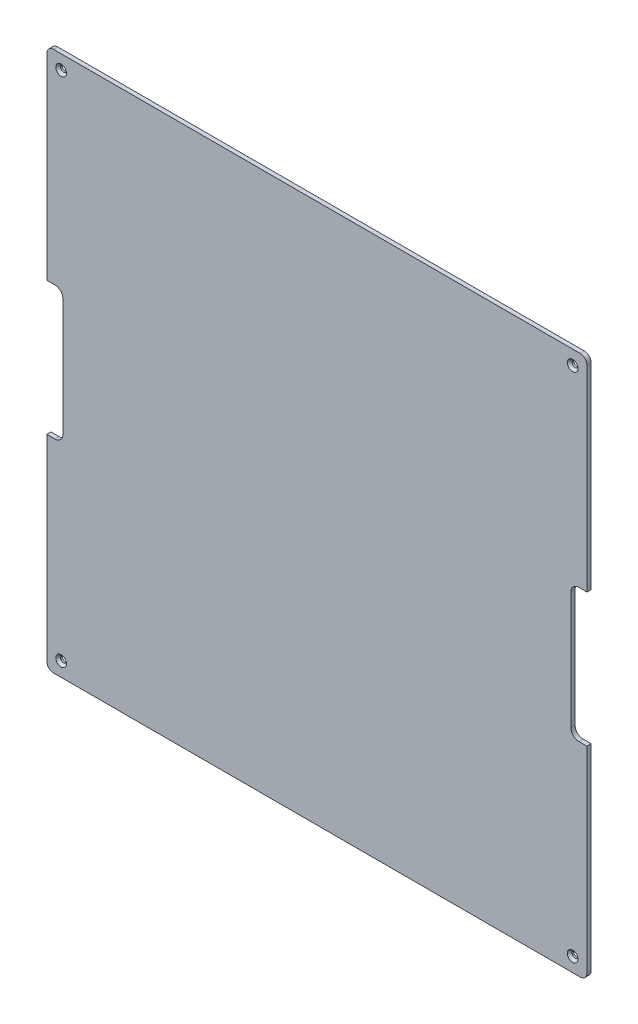
ISO-10303-21;
HEADER;
FILE_DESCRIPTION(('STEP AP214'),'2;1');
FILE_NAME('part.step','',(''),(''),'','','');
FILE_SCHEMA(('AUTOMOTIVE_DESIGN { 1 0 10303 214 1 1 1 1 }'));
ENDSEC;
DATA;
#1=APPLICATION_CONTEXT('core data for automotive mechanical design processes');
#2=APPLICATION_PROTOCOL_DEFINITION('international standard','automotive_design',2000,#1);
#3=PRODUCT_CONTEXT('',#1,'mechanical');
#4=PRODUCT('Part','Part','',(#3));
#5=PRODUCT_RELATED_PRODUCT_CATEGORY('part','',(#4));
#6=PRODUCT_DEFINITION_FORMATION('','',#4);
#7=PRODUCT_DEFINITION_CONTEXT('part definition',#1,'design');
#8=PRODUCT_DEFINITION('design','',#6,#7);
#9=PRODUCT_DEFINITION_SHAPE('','',#8);
#10=(LENGTH_UNIT() NAMED_UNIT(*) SI_UNIT(.MILLI.,.METRE.));
#11=(NAMED_UNIT(*) PLANE_ANGLE_UNIT() SI_UNIT($,.RADIAN.));
#12=(NAMED_UNIT(*) SI_UNIT($,.STERADIAN.) SOLID_ANGLE_UNIT());
#13=UNCERTAINTY_MEASURE_WITH_UNIT(LENGTH_MEASURE(1.E-05),#10,'distance_accuracy_value','');
#14=(GEOMETRIC_REPRESENTATION_CONTEXT(3) GLOBAL_UNCERTAINTY_ASSIGNED_CONTEXT((#13)) GLOBAL_UNIT_ASSIGNED_CONTEXT((#10,
#11,#12)) REPRESENTATION_CONTEXT('',''));
#15=CARTESIAN_POINT('',(0.,0.,0.));
#16=DIRECTION('',(0.,0.,1.));
#17=DIRECTION('',(1.,0.,0.));
#18=AXIS2_PLACEMENT_3D('',#15,#16,#17);
#19=CARTESIAN_POINT('',(3.3021810973961,129.997818902604,1.5748));
#20=DIRECTION('',(0.,1.,0.));
#21=DIRECTION('',(0.,0.,1.));
#22=AXIS2_PLACEMENT_3D('',#19,#20,#21);
#23=PLANE('',#22);
#24=DIRECTION('',(0.,0.,-1.));
#25=VECTOR('',#24,1.);
#26=CARTESIAN_POINT('',(3.80218109739611,129.997818902604,-0.000999999999999916));
#27=LINE('',#26,#25);
#28=CARTESIAN_POINT('',(3.80218109739611,129.997818902604,1.5748));
#29=VERTEX_POINT('',#28);
#30=CARTESIAN_POINT('',(3.80218109739611,129.997818902604,0.));
#31=VERTEX_POINT('',#30);
#32=EDGE_CURVE('E299',#29,#31,#27,.T.);
#33=ORIENTED_EDGE('',*,*,#32,.T.);
#34=DIRECTION('',(1.,0.,0.));
#35=VECTOR('',#34,1.);
#36=CARTESIAN_POINT('',(3.3021810973961,129.997818902604,0.));
#37=LINE('',#36,#35);
#38=CARTESIAN_POINT('',(6.8221810973961,129.997818902604,0.));
#39=VERTEX_POINT('',#38);
#40=EDGE_CURVE('E201',#31,#39,#37,.T.);
#41=ORIENTED_EDGE('',*,*,#40,.T.);
#42=DIRECTION('',(0.,0.,-1.));
#43=VECTOR('',#42,1.);
#44=CARTESIAN_POINT('',(6.8221810973961,129.997818902604,1.5748));
#45=LINE('',#44,#43);
#46=CARTESIAN_POINT('',(6.8221810973961,129.997818902604,1.5748));
#47=VERTEX_POINT('',#46);
#48=EDGE_CURVE('E228',#39,#47,#45,.F.);
#49=ORIENTED_EDGE('',*,*,#48,.T.);
#50=DIRECTION('',(1.,0.,0.));
#51=VECTOR('',#50,1.);
#52=CARTESIAN_POINT('',(3.3021810973961,129.997818902604,1.5748));
#53=LINE('',#52,#51);
#54=EDGE_CURVE('E210',#29,#47,#53,.T.);
#55=ORIENTED_EDGE('',*,*,#54,.F.);
#56=EDGE_LOOP('',(#33,#41,#49,#55));
#57=FACE_BOUND('',#56,.T.);
#58=ADVANCED_FACE('F33',(#57),#23,.F.);
#59=CARTESIAN_POINT('',(3.30218109739611,79.9978189026039,1.5748));
#60=DIRECTION('',(0.,-1.,0.));
#61=DIRECTION('',(0.,0.,-1.));
#62=AXIS2_PLACEMENT_3D('',#59,#60,#61);
#63=PLANE('',#62);
#64=DIRECTION('',(0.,0.,1.));
#65=VECTOR('',#64,1.);
#66=CARTESIAN_POINT('',(3.80218109739612,79.9978189026039,-0.000999999999999916));
#67=LINE('',#66,#65);
#68=CARTESIAN_POINT('',(3.80218109739611,79.9978189026039,0.));
#69=VERTEX_POINT('',#68);
#70=CARTESIAN_POINT('',(3.80218109739611,79.9978189026039,1.5748));
#71=VERTEX_POINT('',#70);
#72=EDGE_CURVE('E168',#69,#71,#67,.T.);
#73=ORIENTED_EDGE('',*,*,#72,.T.);
#74=DIRECTION('',(-1.,0.,0.));
#75=VECTOR('',#74,1.);
#76=CARTESIAN_POINT('',(3.30218109739611,79.9978189026039,1.5748));
#77=LINE('',#76,#75);
#78=CARTESIAN_POINT('',(6.82218109739611,79.9978189026039,1.5748));
#79=VERTEX_POINT('',#78);
#80=EDGE_CURVE('E257',#79,#71,#77,.T.);
#81=ORIENTED_EDGE('',*,*,#80,.F.);
#82=DIRECTION('',(0.,0.,-1.));
#83=VECTOR('',#82,1.);
#84=CARTESIAN_POINT('',(6.82218109739611,79.9978189026039,0.));
#85=LINE('',#84,#83);
#86=CARTESIAN_POINT('',(6.82218109739611,79.9978189026039,0.));
#87=VERTEX_POINT('',#86);
#88=EDGE_CURVE('E194',#79,#87,#85,.T.);
#89=ORIENTED_EDGE('',*,*,#88,.T.);
#90=DIRECTION('',(-1.,0.,0.));
#91=VECTOR('',#90,1.);
#92=CARTESIAN_POINT('',(3.30218109739611,79.9978189026039,0.));
#93=LINE('',#92,#91);
#94=EDGE_CURVE('E186',#87,#69,#93,.T.);
#95=ORIENTED_EDGE('',*,*,#94,.T.);
#96=EDGE_LOOP('',(#73,#81,#89,#95));
#97=FACE_BOUND('',#96,.T.);
#98=ADVANCED_FACE('F192',(#97),#63,.F.);
#99=CARTESIAN_POINT('',(206.702181097396,79.9978189026039,1.5748));
#100=DIRECTION('',(0.,-1.,0.));
#101=DIRECTION('',(0.,0.,-1.));
#102=AXIS2_PLACEMENT_3D('',#99,#100,#101);
#103=PLANE('',#102);
#104=DIRECTION('',(0.,0.,-1.));
#105=VECTOR('',#104,1.);
#106=CARTESIAN_POINT('',(206.202181097396,79.9978189026039,-0.000999999999999916));
#107=LINE('',#106,#105);
#108=CARTESIAN_POINT('',(206.202181097396,79.9978189026039,1.5748));
#109=VERTEX_POINT('',#108);
#110=CARTESIAN_POINT('',(206.202181097396,79.9978189026039,0.));
#111=VERTEX_POINT('',#110);
#112=EDGE_CURVE('E180',#109,#111,#107,.T.);
#113=ORIENTED_EDGE('',*,*,#112,.T.);
#114=DIRECTION('',(-1.,0.,0.));
#115=VECTOR('',#114,1.);
#116=CARTESIAN_POINT('',(206.702181097396,79.9978189026039,0.));
#117=LINE('',#116,#115);
#118=CARTESIAN_POINT('',(203.182181097396,79.9978189026039,0.));
#119=VERTEX_POINT('',#118);
#120=EDGE_CURVE('E195',#111,#119,#117,.T.);
#121=ORIENTED_EDGE('',*,*,#120,.T.);
#122=DIRECTION('',(0.,0.,-1.));
#123=VECTOR('',#122,1.);
#124=CARTESIAN_POINT('',(203.182181097396,79.9978189026039,1.5748));
#125=LINE('',#124,#123);
#126=CARTESIAN_POINT('',(203.182181097396,79.9978189026039,1.5748));
#127=VERTEX_POINT('',#126);
#128=EDGE_CURVE('E220',#119,#127,#125,.F.);
#129=ORIENTED_EDGE('',*,*,#128,.T.);
#130=DIRECTION('',(-1.,0.,0.));
#131=VECTOR('',#130,1.);
#132=CARTESIAN_POINT('',(206.702181097396,79.9978189026039,1.5748));
#133=LINE('',#132,#131);
#134=EDGE_CURVE('E259',#109,#127,#133,.T.);
#135=ORIENTED_EDGE('',*,*,#134,.F.);
#136=EDGE_LOOP('',(#113,#121,#129,#135));
#137=FACE_BOUND('',#136,.T.);
#138=ADVANCED_FACE('F350',(#137),#103,.F.);
#139=CARTESIAN_POINT('',(206.702181097396,129.997818902604,1.5748));
#140=DIRECTION('',(0.,1.,0.));
#141=DIRECTION('',(0.,0.,1.));
#142=AXIS2_PLACEMENT_3D('',#139,#140,#141);
#143=PLANE('',#142);
#144=DIRECTION('',(0.,0.,1.));
#145=VECTOR('',#144,1.);
#146=CARTESIAN_POINT('',(206.202181097396,129.997818902604,-0.000999999999999916));
#147=LINE('',#146,#145);
#148=CARTESIAN_POINT('',(206.202181097396,129.997818902604,0.));
#149=VERTEX_POINT('',#148);
#150=CARTESIAN_POINT('',(206.202181097396,129.997818902604,1.5748));
#151=VERTEX_POINT('',#150);
#152=EDGE_CURVE('E56',#149,#151,#147,.T.);
#153=ORIENTED_EDGE('',*,*,#152,.T.);
#154=DIRECTION('',(1.,0.,0.));
#155=VECTOR('',#154,1.);
#156=CARTESIAN_POINT('',(206.702181097396,129.997818902604,1.5748));
#157=LINE('',#156,#155);
#158=CARTESIAN_POINT('',(203.182181097396,129.997818902604,1.5748));
#159=VERTEX_POINT('',#158);
#160=EDGE_CURVE('E215',#159,#151,#157,.T.);
#161=ORIENTED_EDGE('',*,*,#160,.F.);
#162=DIRECTION('',(0.,0.,-1.));
#163=VECTOR('',#162,1.);
#164=CARTESIAN_POINT('',(203.182181097396,129.997818902604,0.));
#165=LINE('',#164,#163);
#166=CARTESIAN_POINT('',(203.182181097396,129.997818902604,0.));
#167=VERTEX_POINT('',#166);
#168=EDGE_CURVE('E211',#159,#167,#165,.T.);
#169=ORIENTED_EDGE('',*,*,#168,.T.);
#170=DIRECTION('',(1.,0.,0.));
#171=VECTOR('',#170,1.);
#172=CARTESIAN_POINT('',(206.702181097396,129.997818902604,0.));
#173=LINE('',#172,#171);
#174=EDGE_CURVE('E207',#167,#149,#173,.T.);
#175=ORIENTED_EDGE('',*,*,#174,.T.);
#176=EDGE_LOOP('',(#153,#161,#169,#175));
#177=FACE_BOUND('',#176,.T.);
#178=ADVANCED_FACE('F341',(#177),#143,.F.);
#179=CARTESIAN_POINT('',(0.,0.,1.5748));
#180=DIRECTION('',(0.,0.,1.));
#181=DIRECTION('',(1.,0.,0.));
#182=AXIS2_PLACEMENT_3D('',#179,#180,#181);
#183=PLANE('',#182);
#184=CARTESIAN_POINT('',(200.848909451302,9.15109054869805,1.5748));
#185=DIRECTION('',(0.,0.,1.));
#186=DIRECTION('',(1.,0.,0.));
#187=AXIS2_PLACEMENT_3D('',#184,#185,#186);
#188=CIRCLE('',#187,2.);
#189=CARTESIAN_POINT('',(202.848909451302,9.15109054869805,1.5748));
#190=VERTEX_POINT('',#189);
#191=EDGE_CURVE('E179',#190,#190,#188,.T.);
#192=ORIENTED_EDGE('',*,*,#191,.F.);
#193=EDGE_LOOP('',(#192));
#194=FACE_BOUND('',#193,.T.);
#195=CARTESIAN_POINT('',(9.15109054869807,9.15109054869805,1.5748));
#196=DIRECTION('',(0.,0.,1.));
#197=DIRECTION('',(1.,0.,0.));
#198=AXIS2_PLACEMENT_3D('',#195,#196,#197);
#199=CIRCLE('',#198,2.);
#200=CARTESIAN_POINT('',(11.1510905486981,9.15109054869805,1.5748));
#201=VERTEX_POINT('',#200);
#202=EDGE_CURVE('E318',#201,#201,#199,.T.);
#203=ORIENTED_EDGE('',*,*,#202,.F.);
#204=EDGE_LOOP('',(#203));
#205=FACE_BOUND('',#204,.T.);
#206=CARTESIAN_POINT('',(200.848909451302,200.848909451302,1.5748));
#207=DIRECTION('',(0.,0.,1.));
#208=DIRECTION('',(1.,0.,0.));
#209=AXIS2_PLACEMENT_3D('',#206,#207,#208);
#210=CIRCLE('',#209,2.);
#211=CARTESIAN_POINT('',(202.848909451302,200.848909451302,1.5748));
#212=VERTEX_POINT('',#211);
#213=EDGE_CURVE('E327',#212,#212,#210,.T.);
#214=ORIENTED_EDGE('',*,*,#213,.F.);
#215=EDGE_LOOP('',(#214));
#216=FACE_BOUND('',#215,.T.);
#217=CARTESIAN_POINT('',(9.15109054869803,200.848909451302,1.5748));
#218=DIRECTION('',(0.,0.,1.));
#219=DIRECTION('',(1.,0.,0.));
#220=AXIS2_PLACEMENT_3D('',#217,#218,#219);
#221=CIRCLE('',#220,2.);
#222=CARTESIAN_POINT('',(11.151090548698,200.848909451302,1.5748));
#223=VERTEX_POINT('',#222);
#224=EDGE_CURVE('E279',#223,#223,#221,.T.);
#225=ORIENTED_EDGE('',*,*,#224,.F.);
#226=EDGE_LOOP('',(#225));
#227=FACE_BOUND('',#226,.T.);
#228=CARTESIAN_POINT('',(203.702181097396,6.29781890260394,1.5748));
#229=DIRECTION('',(0.,0.,1.));
#230=DIRECTION('',(1.,0.,0.));
#231=AXIS2_PLACEMENT_3D('',#228,#229,#230);
#232=CIRCLE('',#231,2.5);
#233=CARTESIAN_POINT('',(203.702181097396,3.79781890260396,1.5748));
#234=VERTEX_POINT('',#233);
#235=CARTESIAN_POINT('',(206.202181097396,6.29781890260394,1.5748));
#236=VERTEX_POINT('',#235);
#237=EDGE_CURVE('E674',#234,#236,#232,.T.);
#238=ORIENTED_EDGE('',*,*,#237,.T.);
#239=DIRECTION('',(0.,1.,0.));
#240=VECTOR('',#239,1.);
#241=CARTESIAN_POINT('',(206.202181097396,6.29781890260394,1.5748));
#242=LINE('',#241,#240);
#243=EDGE_CURVE('E672',#236,#109,#242,.T.);
#244=ORIENTED_EDGE('',*,*,#243,.T.);
#245=ORIENTED_EDGE('',*,*,#134,.T.);
#246=CARTESIAN_POINT('',(203.182181097396,82.9978189026039,1.5748));
#247=DIRECTION('',(0.,0.,1.));
#248=DIRECTION('',(1.,0.,0.));
#249=AXIS2_PLACEMENT_3D('',#246,#247,#248);
#250=CIRCLE('',#249,3.);
#251=CARTESIAN_POINT('',(200.182181097396,82.9978189026039,1.5748));
#252=VERTEX_POINT('',#251);
#253=EDGE_CURVE('E239',#127,#252,#250,.F.);
#254=ORIENTED_EDGE('',*,*,#253,.T.);
#255=DIRECTION('',(0.,1.,0.));
#256=VECTOR('',#255,1.);
#257=CARTESIAN_POINT('',(200.182181097396,129.997818902604,1.5748));
#258=LINE('',#257,#256);
#259=CARTESIAN_POINT('',(200.182181097396,126.997818902604,1.5748));
#260=VERTEX_POINT('',#259);
#261=EDGE_CURVE('E261',#252,#260,#258,.T.);
#262=ORIENTED_EDGE('',*,*,#261,.T.);
#263=CARTESIAN_POINT('',(203.182181097396,126.997818902604,1.5748));
#264=DIRECTION('',(0.,0.,1.));
#265=DIRECTION('',(1.,0.,0.));
#266=AXIS2_PLACEMENT_3D('',#263,#264,#265);
#267=CIRCLE('',#266,3.);
#268=EDGE_CURVE('E234',#260,#159,#267,.F.);
#269=ORIENTED_EDGE('',*,*,#268,.T.);
#270=ORIENTED_EDGE('',*,*,#160,.T.);
#271=DIRECTION('',(0.,1.,0.));
#272=VECTOR('',#271,1.);
#273=CARTESIAN_POINT('',(206.202181097396,6.29781890260394,1.5748));
#274=LINE('',#273,#272);
#275=CARTESIAN_POINT('',(206.202181097396,203.697818902604,1.5748));
#276=VERTEX_POINT('',#275);
#277=EDGE_CURVE('E305',#151,#276,#274,.T.);
#278=ORIENTED_EDGE('',*,*,#277,.T.);
#279=CARTESIAN_POINT('',(203.702181097396,203.697818902604,1.5748));
#280=DIRECTION('',(0.,0.,1.));
#281=DIRECTION('',(1.,0.,0.));
#282=AXIS2_PLACEMENT_3D('',#279,#280,#281);
#283=CIRCLE('',#282,2.5);
#284=CARTESIAN_POINT('',(203.702181097396,206.197818902604,1.5748));
#285=VERTEX_POINT('',#284);
#286=EDGE_CURVE('E309',#276,#285,#283,.T.);
#287=ORIENTED_EDGE('',*,*,#286,.T.);
#288=DIRECTION('',(-1.,0.,0.));
#289=VECTOR('',#288,1.);
#290=CARTESIAN_POINT('',(203.702181097396,206.197818902604,1.5748));
#291=LINE('',#290,#289);
#292=CARTESIAN_POINT('',(6.30218109739614,206.197818902604,1.5748));
#293=VERTEX_POINT('',#292);
#294=EDGE_CURVE('E467',#285,#293,#291,.T.);
#295=ORIENTED_EDGE('',*,*,#294,.T.);
#296=CARTESIAN_POINT('',(6.30218109739609,203.697818902604,1.5748));
#297=DIRECTION('',(0.,0.,1.));
#298=DIRECTION('',(1.,0.,0.));
#299=AXIS2_PLACEMENT_3D('',#296,#297,#298);
#300=CIRCLE('',#299,2.50000000000002);
#301=CARTESIAN_POINT('',(3.80218109739608,203.697818902604,1.5748));
#302=VERTEX_POINT('',#301);
#303=EDGE_CURVE('E470',#293,#302,#300,.T.);
#304=ORIENTED_EDGE('',*,*,#303,.T.);
#305=DIRECTION('',(0.,-1.,0.));
#306=VECTOR('',#305,1.);
#307=CARTESIAN_POINT('',(3.80218109739609,203.697818902604,1.5748));
#308=LINE('',#307,#306);
#309=EDGE_CURVE('E287',#302,#29,#308,.T.);
#310=ORIENTED_EDGE('',*,*,#309,.T.);
#311=ORIENTED_EDGE('',*,*,#54,.T.);
#312=CARTESIAN_POINT('',(6.8221810973961,126.997818902604,1.5748));
#313=DIRECTION('',(0.,0.,1.));
#314=DIRECTION('',(1.,0.,0.));
#315=AXIS2_PLACEMENT_3D('',#312,#313,#314);
#316=CIRCLE('',#315,3.);
#317=CARTESIAN_POINT('',(9.8221810973961,126.997818902604,1.5748));
#318=VERTEX_POINT('',#317);
#319=EDGE_CURVE('E244',#47,#318,#316,.F.);
#320=ORIENTED_EDGE('',*,*,#319,.T.);
#321=DIRECTION('',(0.,-1.,0.));
#322=VECTOR('',#321,1.);
#323=CARTESIAN_POINT('',(9.8221810973961,129.997818902604,1.5748));
#324=LINE('',#323,#322);
#325=CARTESIAN_POINT('',(9.82218109739611,82.9978189026039,1.5748));
#326=VERTEX_POINT('',#325);
#327=EDGE_CURVE('E258',#318,#326,#324,.T.);
#328=ORIENTED_EDGE('',*,*,#327,.T.);
#329=CARTESIAN_POINT('',(6.82218109739611,82.9978189026039,1.5748));
#330=DIRECTION('',(0.,0.,1.));
#331=DIRECTION('',(1.,0.,0.));
#332=AXIS2_PLACEMENT_3D('',#329,#330,#331);
#333=CIRCLE('',#332,3.);
#334=EDGE_CURVE('E11',#326,#79,#333,.F.);
#335=ORIENTED_EDGE('',*,*,#334,.T.);
#336=ORIENTED_EDGE('',*,*,#80,.T.);
#337=DIRECTION('',(0.,-1.,0.));
#338=VECTOR('',#337,1.);
#339=CARTESIAN_POINT('',(3.80218109739609,203.697818902604,1.5748));
#340=LINE('',#339,#338);
#341=CARTESIAN_POINT('',(3.80218109739613,6.29781890260395,1.5748));
#342=VERTEX_POINT('',#341);
#343=EDGE_CURVE('E174',#71,#342,#340,.T.);
#344=ORIENTED_EDGE('',*,*,#343,.T.);
#345=CARTESIAN_POINT('',(6.30218109739612,6.29781890260394,1.5748));
#346=DIRECTION('',(0.,0.,1.));
#347=DIRECTION('',(1.,0.,0.));
#348=AXIS2_PLACEMENT_3D('',#345,#346,#347);
#349=CIRCLE('',#348,2.49999999999999);
#350=CARTESIAN_POINT('',(6.30218109739612,3.79781890260394,1.5748));
#351=VERTEX_POINT('',#350);
#352=EDGE_CURVE('E189',#342,#351,#349,.T.);
#353=ORIENTED_EDGE('',*,*,#352,.T.);
#354=DIRECTION('',(1.,0.,0.));
#355=VECTOR('',#354,1.);
#356=CARTESIAN_POINT('',(6.30218109739612,3.79781890260394,1.5748));
#357=LINE('',#356,#355);
#358=EDGE_CURVE('E680',#351,#234,#357,.T.);
#359=ORIENTED_EDGE('',*,*,#358,.T.);
#360=EDGE_LOOP('',(#238,#244,#245,#254,#262,#269,#270,#278,#287,#295,#304,#310,#311,#320,#328,
#335,#336,#344,#353,#359));
#361=FACE_BOUND('',#360,.T.);
#362=ADVANCED_FACE('F256',(#194,#205,#216,#227,#361),#183,.T.);
#363=CARTESIAN_POINT('',(0.,0.,0.));
#364=DIRECTION('',(0.,0.,1.));
#365=DIRECTION('',(1.,0.,0.));
#366=AXIS2_PLACEMENT_3D('',#363,#364,#365);
#367=PLANE('',#366);
#368=CARTESIAN_POINT('',(200.848909451302,9.15109054869805,0.));
#369=DIRECTION('',(0.,0.,1.));
#370=DIRECTION('',(1.,0.,0.));
#371=AXIS2_PLACEMENT_3D('',#368,#369,#370);
#372=CIRCLE('',#371,1.09999999999999);
#373=CARTESIAN_POINT('',(201.948909451302,9.15109054869805,0.));
#374=VERTEX_POINT('',#373);
#375=EDGE_CURVE('E315',#374,#374,#372,.T.);
#376=ORIENTED_EDGE('',*,*,#375,.T.);
#377=EDGE_LOOP('',(#376));
#378=FACE_BOUND('',#377,.T.);
#379=CARTESIAN_POINT('',(9.15109054869807,9.15109054869805,0.));
#380=DIRECTION('',(0.,0.,1.));
#381=DIRECTION('',(1.,0.,0.));
#382=AXIS2_PLACEMENT_3D('',#379,#380,#381);
#383=CIRCLE('',#382,1.1);
#384=CARTESIAN_POINT('',(10.2510905486981,9.15109054869805,0.));
#385=VERTEX_POINT('',#384);
#386=EDGE_CURVE('E324',#385,#385,#383,.T.);
#387=ORIENTED_EDGE('',*,*,#386,.T.);
#388=EDGE_LOOP('',(#387));
#389=FACE_BOUND('',#388,.T.);
#390=CARTESIAN_POINT('',(200.848909451302,200.848909451302,0.));
#391=DIRECTION('',(0.,0.,1.));
#392=DIRECTION('',(1.,0.,0.));
#393=AXIS2_PLACEMENT_3D('',#390,#391,#392);
#394=CIRCLE('',#393,1.09999999999999);
#395=CARTESIAN_POINT('',(201.948909451302,200.848909451302,0.));
#396=VERTEX_POINT('',#395);
#397=EDGE_CURVE('E333',#396,#396,#394,.T.);
#398=ORIENTED_EDGE('',*,*,#397,.T.);
#399=EDGE_LOOP('',(#398));
#400=FACE_BOUND('',#399,.T.);
#401=CARTESIAN_POINT('',(9.15109054869803,200.848909451302,0.));
#402=DIRECTION('',(0.,0.,1.));
#403=DIRECTION('',(1.,0.,0.));
#404=AXIS2_PLACEMENT_3D('',#401,#402,#403);
#405=CIRCLE('',#404,1.1);
#406=CARTESIAN_POINT('',(10.251090548698,200.848909451302,0.));
#407=VERTEX_POINT('',#406);
#408=EDGE_CURVE('E269',#407,#407,#405,.T.);
#409=ORIENTED_EDGE('',*,*,#408,.T.);
#410=EDGE_LOOP('',(#409));
#411=FACE_BOUND('',#410,.T.);
#412=DIRECTION('',(0.,-1.,0.));
#413=VECTOR('',#412,1.);
#414=CARTESIAN_POINT('',(206.202181097396,6.29781890260394,0.));
#415=LINE('',#414,#413);
#416=CARTESIAN_POINT('',(206.202181097396,6.29781890260394,0.));
#417=VERTEX_POINT('',#416);
#418=EDGE_CURVE('E447',#111,#417,#415,.T.);
#419=ORIENTED_EDGE('',*,*,#418,.T.);
#420=CARTESIAN_POINT('',(203.702181097396,6.29781890260394,0.));
#421=DIRECTION('',(0.,0.,1.));
#422=DIRECTION('',(1.,0.,0.));
#423=AXIS2_PLACEMENT_3D('',#420,#421,#422);
#424=CIRCLE('',#423,2.5);
#425=CARTESIAN_POINT('',(203.702181097396,3.79781890260396,0.));
#426=VERTEX_POINT('',#425);
#427=EDGE_CURVE('E460',#417,#426,#424,.F.);
#428=ORIENTED_EDGE('',*,*,#427,.T.);
#429=DIRECTION('',(-1.,0.,0.));
#430=VECTOR('',#429,1.);
#431=CARTESIAN_POINT('',(6.30218109739612,3.79781890260394,0.));
#432=LINE('',#431,#430);
#433=CARTESIAN_POINT('',(6.30218109739612,3.79781890260394,0.));
#434=VERTEX_POINT('',#433);
#435=EDGE_CURVE('E444',#426,#434,#432,.T.);
#436=ORIENTED_EDGE('',*,*,#435,.T.);
#437=CARTESIAN_POINT('',(6.30218109739612,6.29781890260394,0.));
#438=DIRECTION('',(0.,0.,1.));
#439=DIRECTION('',(1.,0.,0.));
#440=AXIS2_PLACEMENT_3D('',#437,#438,#439);
#441=CIRCLE('',#440,2.49999999999999);
#442=CARTESIAN_POINT('',(3.80218109739613,6.29781890260395,0.));
#443=VERTEX_POINT('',#442);
#444=EDGE_CURVE('E188',#434,#443,#441,.F.);
#445=ORIENTED_EDGE('',*,*,#444,.T.);
#446=DIRECTION('',(0.,1.,0.));
#447=VECTOR('',#446,1.);
#448=CARTESIAN_POINT('',(3.80218109739609,203.697818902604,0.));
#449=LINE('',#448,#447);
#450=EDGE_CURVE('E171',#443,#69,#449,.T.);
#451=ORIENTED_EDGE('',*,*,#450,.T.);
#452=ORIENTED_EDGE('',*,*,#94,.F.);
#453=CARTESIAN_POINT('',(6.82218109739611,82.9978189026039,0.));
#454=DIRECTION('',(0.,0.,1.));
#455=DIRECTION('',(1.,0.,0.));
#456=AXIS2_PLACEMENT_3D('',#453,#454,#455);
#457=CIRCLE('',#456,3.);
#458=CARTESIAN_POINT('',(9.82218109739611,82.9978189026039,0.));
#459=VERTEX_POINT('',#458);
#460=EDGE_CURVE('E41',#87,#459,#457,.T.);
#461=ORIENTED_EDGE('',*,*,#460,.T.);
#462=DIRECTION('',(0.,-1.,0.));
#463=VECTOR('',#462,1.);
#464=CARTESIAN_POINT('',(9.8221810973961,129.997818902604,0.));
#465=LINE('',#464,#463);
#466=CARTESIAN_POINT('',(9.8221810973961,126.997818902604,0.));
#467=VERTEX_POINT('',#466);
#468=EDGE_CURVE('E196',#467,#459,#465,.T.);
#469=ORIENTED_EDGE('',*,*,#468,.F.);
#470=CARTESIAN_POINT('',(6.8221810973961,126.997818902604,0.));
#471=DIRECTION('',(0.,0.,1.));
#472=DIRECTION('',(1.,0.,0.));
#473=AXIS2_PLACEMENT_3D('',#470,#471,#472);
#474=CIRCLE('',#473,3.);
#475=EDGE_CURVE('E241',#467,#39,#474,.T.);
#476=ORIENTED_EDGE('',*,*,#475,.T.);
#477=ORIENTED_EDGE('',*,*,#40,.F.);
#478=DIRECTION('',(0.,1.,0.));
#479=VECTOR('',#478,1.);
#480=CARTESIAN_POINT('',(3.80218109739609,203.697818902604,0.));
#481=LINE('',#480,#479);
#482=CARTESIAN_POINT('',(3.80218109739608,203.697818902604,0.));
#483=VERTEX_POINT('',#482);
#484=EDGE_CURVE('E293',#31,#483,#481,.T.);
#485=ORIENTED_EDGE('',*,*,#484,.T.);
#486=CARTESIAN_POINT('',(6.30218109739609,203.697818902604,0.));
#487=DIRECTION('',(0.,0.,1.));
#488=DIRECTION('',(1.,0.,0.));
#489=AXIS2_PLACEMENT_3D('',#486,#487,#488);
#490=CIRCLE('',#489,2.50000000000002);
#491=CARTESIAN_POINT('',(6.30218109739614,206.197818902604,0.));
#492=VERTEX_POINT('',#491);
#493=EDGE_CURVE('E295',#483,#492,#490,.F.);
#494=ORIENTED_EDGE('',*,*,#493,.T.);
#495=DIRECTION('',(1.,0.,0.));
#496=VECTOR('',#495,1.);
#497=CARTESIAN_POINT('',(203.702181097396,206.197818902604,0.));
#498=LINE('',#497,#496);
#499=CARTESIAN_POINT('',(203.702181097396,206.197818902604,0.));
#500=VERTEX_POINT('',#499);
#501=EDGE_CURVE('E468',#492,#500,#498,.T.);
#502=ORIENTED_EDGE('',*,*,#501,.T.);
#503=CARTESIAN_POINT('',(203.702181097396,203.697818902604,0.));
#504=DIRECTION('',(0.,0.,1.));
#505=DIRECTION('',(1.,0.,0.));
#506=AXIS2_PLACEMENT_3D('',#503,#504,#505);
#507=CIRCLE('',#506,2.5);
#508=CARTESIAN_POINT('',(206.202181097396,203.697818902604,0.));
#509=VERTEX_POINT('',#508);
#510=EDGE_CURVE('E464',#500,#509,#507,.F.);
#511=ORIENTED_EDGE('',*,*,#510,.T.);
#512=DIRECTION('',(0.,-1.,0.));
#513=VECTOR('',#512,1.);
#514=CARTESIAN_POINT('',(206.202181097396,6.29781890260394,0.));
#515=LINE('',#514,#513);
#516=EDGE_CURVE('E307',#509,#149,#515,.T.);
#517=ORIENTED_EDGE('',*,*,#516,.T.);
#518=ORIENTED_EDGE('',*,*,#174,.F.);
#519=CARTESIAN_POINT('',(203.182181097396,126.997818902604,0.));
#520=DIRECTION('',(0.,0.,1.));
#521=DIRECTION('',(1.,0.,0.));
#522=AXIS2_PLACEMENT_3D('',#519,#520,#521);
#523=CIRCLE('',#522,3.);
#524=CARTESIAN_POINT('',(200.182181097396,126.997818902604,0.));
#525=VERTEX_POINT('',#524);
#526=EDGE_CURVE('E232',#167,#525,#523,.T.);
#527=ORIENTED_EDGE('',*,*,#526,.T.);
#528=DIRECTION('',(0.,1.,0.));
#529=VECTOR('',#528,1.);
#530=CARTESIAN_POINT('',(200.182181097396,129.997818902604,0.));
#531=LINE('',#530,#529);
#532=CARTESIAN_POINT('',(200.182181097396,82.9978189026039,0.));
#533=VERTEX_POINT('',#532);
#534=EDGE_CURVE('E198',#533,#525,#531,.T.);
#535=ORIENTED_EDGE('',*,*,#534,.F.);
#536=CARTESIAN_POINT('',(203.182181097396,82.9978189026039,0.));
#537=DIRECTION('',(0.,0.,1.));
#538=DIRECTION('',(1.,0.,0.));
#539=AXIS2_PLACEMENT_3D('',#536,#537,#538);
#540=CIRCLE('',#539,3.);
#541=EDGE_CURVE('E236',#533,#119,#540,.T.);
#542=ORIENTED_EDGE('',*,*,#541,.T.);
#543=ORIENTED_EDGE('',*,*,#120,.F.);
#544=EDGE_LOOP('',(#419,#428,#436,#445,#451,#452,#461,#469,#476,#477,#485,#494,#502,#511,#517,
#518,#527,#535,#542,#543));
#545=FACE_BOUND('',#544,.T.);
#546=ADVANCED_FACE('F185',(#378,#389,#400,#411,#545),#367,.F.);
#547=CARTESIAN_POINT('',(9.8221810973961,129.997818902604,1.5748));
#548=DIRECTION('',(1.,0.,0.));
#549=DIRECTION('',(0.,1.,0.));
#550=AXIS2_PLACEMENT_3D('',#547,#548,#549);
#551=PLANE('',#550);
#552=ORIENTED_EDGE('',*,*,#327,.F.);
#553=DIRECTION('',(0.,0.,-1.));
#554=VECTOR('',#553,1.);
#555=CARTESIAN_POINT('',(9.8221810973961,126.997818902604,0.));
#556=LINE('',#555,#554);
#557=EDGE_CURVE('E225',#318,#467,#556,.T.);
#558=ORIENTED_EDGE('',*,*,#557,.T.);
#559=ORIENTED_EDGE('',*,*,#468,.T.);
#560=DIRECTION('',(0.,0.,-1.));
#561=VECTOR('',#560,1.);
#562=CARTESIAN_POINT('',(9.82218109739611,82.9978189026039,1.5748));
#563=LINE('',#562,#561);
#564=EDGE_CURVE('E223',#459,#326,#563,.F.);
#565=ORIENTED_EDGE('',*,*,#564,.T.);
#566=EDGE_LOOP('',(#552,#558,#559,#565));
#567=FACE_BOUND('',#566,.T.);
#568=ADVANCED_FACE('F250',(#567),#551,.F.);
#569=CARTESIAN_POINT('',(200.182181097396,129.997818902604,1.5748));
#570=DIRECTION('',(-1.,0.,0.));
#571=DIRECTION('',(0.,0.,1.));
#572=AXIS2_PLACEMENT_3D('',#569,#570,#571);
#573=PLANE('',#572);
#574=ORIENTED_EDGE('',*,*,#534,.T.);
#575=DIRECTION('',(0.,0.,-1.));
#576=VECTOR('',#575,1.);
#577=CARTESIAN_POINT('',(200.182181097396,126.997818902604,1.5748));
#578=LINE('',#577,#576);
#579=EDGE_CURVE('E218',#525,#260,#578,.F.);
#580=ORIENTED_EDGE('',*,*,#579,.T.);
#581=ORIENTED_EDGE('',*,*,#261,.F.);
#582=DIRECTION('',(0.,0.,-1.));
#583=VECTOR('',#582,1.);
#584=CARTESIAN_POINT('',(200.182181097396,82.9978189026039,0.));
#585=LINE('',#584,#583);
#586=EDGE_CURVE('E214',#252,#533,#585,.T.);
#587=ORIENTED_EDGE('',*,*,#586,.T.);
#588=EDGE_LOOP('',(#574,#580,#581,#587));
#589=FACE_BOUND('',#588,.T.);
#590=ADVANCED_FACE('F421',(#589),#573,.F.);
#591=CARTESIAN_POINT('',(9.15109054869803,200.848909451302,1.5748));
#592=DIRECTION('',(0.,0.,1.));
#593=DIRECTION('',(1.,0.,0.));
#594=AXIS2_PLACEMENT_3D('',#591,#592,#593);
#595=CYLINDRICAL_SURFACE('',#594,1.1);
#596=ORIENTED_EDGE('',*,*,#408,.F.);
#597=EDGE_LOOP('',(#596));
#598=FACE_BOUND('',#597,.T.);
#599=CARTESIAN_POINT('',(9.15109054869803,200.848909451302,0.6748));
#600=DIRECTION('',(0.,0.,1.));
#601=DIRECTION('',(1.,0.,0.));
#602=AXIS2_PLACEMENT_3D('',#599,#600,#601);
#603=CIRCLE('',#602,1.1);
#604=CARTESIAN_POINT('',(10.251090548698,200.848909451302,0.6748));
#605=VERTEX_POINT('',#604);
#606=EDGE_CURVE('E274',#605,#605,#603,.T.);
#607=ORIENTED_EDGE('',*,*,#606,.T.);
#608=EDGE_LOOP('',(#607));
#609=FACE_BOUND('',#608,.T.);
#610=ADVANCED_FACE('F418',(#598,#609),#595,.F.);
#611=CARTESIAN_POINT('',(9.15109054869803,200.848909451302,1.5748));
#612=DIRECTION('',(0.,0.,1.));
#613=DIRECTION('',(1.,0.,0.));
#614=AXIS2_PLACEMENT_3D('',#611,#612,#613);
#615=CONICAL_SURFACE('',#614,2.,0.785398163397448);
#616=ORIENTED_EDGE('',*,*,#606,.F.);
#617=EDGE_LOOP('',(#616));
#618=FACE_BOUND('',#617,.T.);
#619=ORIENTED_EDGE('',*,*,#224,.T.);
#620=EDGE_LOOP('',(#619));
#621=FACE_BOUND('',#620,.T.);
#622=ADVANCED_FACE('F338',(#618,#621),#615,.F.);
#623=CARTESIAN_POINT('',(200.848909451302,200.848909451302,1.5748));
#624=DIRECTION('',(0.,0.,1.));
#625=DIRECTION('',(1.,0.,0.));
#626=AXIS2_PLACEMENT_3D('',#623,#624,#625);
#627=CYLINDRICAL_SURFACE('',#626,1.09999999999999);
#628=ORIENTED_EDGE('',*,*,#397,.F.);
#629=EDGE_LOOP('',(#628));
#630=FACE_BOUND('',#629,.T.);
#631=CARTESIAN_POINT('',(200.848909451302,200.848909451302,0.6748));
#632=DIRECTION('',(0.,0.,1.));
#633=DIRECTION('',(1.,0.,0.));
#634=AXIS2_PLACEMENT_3D('',#631,#632,#633);
#635=CIRCLE('',#634,1.09999999999999);
#636=CARTESIAN_POINT('',(201.948909451302,200.848909451302,0.6748));
#637=VERTEX_POINT('',#636);
#638=EDGE_CURVE('E330',#637,#637,#635,.T.);
#639=ORIENTED_EDGE('',*,*,#638,.T.);
#640=EDGE_LOOP('',(#639));
#641=FACE_BOUND('',#640,.T.);
#642=ADVANCED_FACE('F412',(#630,#641),#627,.F.);
#643=CARTESIAN_POINT('',(200.848909451302,200.848909451302,1.5748));
#644=DIRECTION('',(0.,0.,1.));
#645=DIRECTION('',(1.,0.,0.));
#646=AXIS2_PLACEMENT_3D('',#643,#644,#645);
#647=CONICAL_SURFACE('',#646,2.,0.785398163397455);
#648=ORIENTED_EDGE('',*,*,#638,.F.);
#649=EDGE_LOOP('',(#648));
#650=FACE_BOUND('',#649,.T.);
#651=ORIENTED_EDGE('',*,*,#213,.T.);
#652=EDGE_LOOP('',(#651));
#653=FACE_BOUND('',#652,.T.);
#654=ADVANCED_FACE('F408',(#650,#653),#647,.F.);
#655=CARTESIAN_POINT('',(9.15109054869807,9.15109054869805,1.5748));
#656=DIRECTION('',(0.,0.,1.));
#657=DIRECTION('',(1.,0.,0.));
#658=AXIS2_PLACEMENT_3D('',#655,#656,#657);
#659=CYLINDRICAL_SURFACE('',#658,1.1);
#660=ORIENTED_EDGE('',*,*,#386,.F.);
#661=EDGE_LOOP('',(#660));
#662=FACE_BOUND('',#661,.T.);
#663=CARTESIAN_POINT('',(9.15109054869807,9.15109054869805,0.6748));
#664=DIRECTION('',(0.,0.,1.));
#665=DIRECTION('',(1.,0.,0.));
#666=AXIS2_PLACEMENT_3D('',#663,#664,#665);
#667=CIRCLE('',#666,1.1);
#668=CARTESIAN_POINT('',(10.2510905486981,9.15109054869805,0.6748));
#669=VERTEX_POINT('',#668);
#670=EDGE_CURVE('E321',#669,#669,#667,.T.);
#671=ORIENTED_EDGE('',*,*,#670,.T.);
#672=EDGE_LOOP('',(#671));
#673=FACE_BOUND('',#672,.T.);
#674=ADVANCED_FACE('F404',(#662,#673),#659,.F.);
#675=CARTESIAN_POINT('',(9.15109054869807,9.15109054869805,1.5748));
#676=DIRECTION('',(0.,0.,1.));
#677=DIRECTION('',(1.,0.,0.));
#678=AXIS2_PLACEMENT_3D('',#675,#676,#677);
#679=CONICAL_SURFACE('',#678,2.,0.785398163397448);
#680=ORIENTED_EDGE('',*,*,#670,.F.);
#681=EDGE_LOOP('',(#680));
#682=FACE_BOUND('',#681,.T.);
#683=ORIENTED_EDGE('',*,*,#202,.T.);
#684=EDGE_LOOP('',(#683));
#685=FACE_BOUND('',#684,.T.);
#686=ADVANCED_FACE('F400',(#682,#685),#679,.F.);
#687=CARTESIAN_POINT('',(200.848909451302,9.15109054869805,1.5748));
#688=DIRECTION('',(0.,0.,1.));
#689=DIRECTION('',(1.,0.,0.));
#690=AXIS2_PLACEMENT_3D('',#687,#688,#689);
#691=CYLINDRICAL_SURFACE('',#690,1.09999999999999);
#692=ORIENTED_EDGE('',*,*,#375,.F.);
#693=EDGE_LOOP('',(#692));
#694=FACE_BOUND('',#693,.T.);
#695=CARTESIAN_POINT('',(200.848909451302,9.15109054869805,0.6748));
#696=DIRECTION('',(0.,0.,1.));
#697=DIRECTION('',(1.,0.,0.));
#698=AXIS2_PLACEMENT_3D('',#695,#696,#697);
#699=CIRCLE('',#698,1.09999999999999);
#700=CARTESIAN_POINT('',(201.948909451302,9.15109054869805,0.6748));
#701=VERTEX_POINT('',#700);
#702=EDGE_CURVE('E312',#701,#701,#699,.T.);
#703=ORIENTED_EDGE('',*,*,#702,.T.);
#704=EDGE_LOOP('',(#703));
#705=FACE_BOUND('',#704,.T.);
#706=ADVANCED_FACE('F396',(#694,#705),#691,.F.);
#707=CARTESIAN_POINT('',(200.848909451302,9.15109054869805,1.5748));
#708=DIRECTION('',(0.,0.,1.));
#709=DIRECTION('',(1.,0.,0.));
#710=AXIS2_PLACEMENT_3D('',#707,#708,#709);
#711=CONICAL_SURFACE('',#710,2.,0.785398163397455);
#712=ORIENTED_EDGE('',*,*,#702,.F.);
#713=EDGE_LOOP('',(#712));
#714=FACE_BOUND('',#713,.T.);
#715=ORIENTED_EDGE('',*,*,#191,.T.);
#716=EDGE_LOOP('',(#715));
#717=FACE_BOUND('',#716,.T.);
#718=ADVANCED_FACE('F368',(#714,#717),#711,.F.);
#719=CARTESIAN_POINT('',(203.182181097396,126.997818902604,1.5748));
#720=DIRECTION('',(0.,0.,1.));
#721=DIRECTION('',(1.,0.,0.));
#722=AXIS2_PLACEMENT_3D('',#719,#720,#721);
#723=CYLINDRICAL_SURFACE('',#722,3.);
#724=ORIENTED_EDGE('',*,*,#268,.F.);
#725=ORIENTED_EDGE('',*,*,#579,.F.);
#726=ORIENTED_EDGE('',*,*,#526,.F.);
#727=ORIENTED_EDGE('',*,*,#168,.F.);
#728=EDGE_LOOP('',(#724,#725,#726,#727));
#729=FACE_BOUND('',#728,.T.);
#730=ADVANCED_FACE('F364',(#729),#723,.F.);
#731=CARTESIAN_POINT('',(203.182181097396,82.9978189026039,1.5748));
#732=DIRECTION('',(0.,0.,1.));
#733=DIRECTION('',(1.,0.,0.));
#734=AXIS2_PLACEMENT_3D('',#731,#732,#733);
#735=CYLINDRICAL_SURFACE('',#734,3.);
#736=ORIENTED_EDGE('',*,*,#253,.F.);
#737=ORIENTED_EDGE('',*,*,#128,.F.);
#738=ORIENTED_EDGE('',*,*,#541,.F.);
#739=ORIENTED_EDGE('',*,*,#586,.F.);
#740=EDGE_LOOP('',(#736,#737,#738,#739));
#741=FACE_BOUND('',#740,.T.);
#742=ADVANCED_FACE('F367',(#741),#735,.F.);
#743=CARTESIAN_POINT('',(6.8221810973961,126.997818902604,1.5748));
#744=DIRECTION('',(0.,0.,1.));
#745=DIRECTION('',(1.,0.,0.));
#746=AXIS2_PLACEMENT_3D('',#743,#744,#745);
#747=CYLINDRICAL_SURFACE('',#746,3.);
#748=ORIENTED_EDGE('',*,*,#319,.F.);
#749=ORIENTED_EDGE('',*,*,#48,.F.);
#750=ORIENTED_EDGE('',*,*,#475,.F.);
#751=ORIENTED_EDGE('',*,*,#557,.F.);
#752=EDGE_LOOP('',(#748,#749,#750,#751));
#753=FACE_BOUND('',#752,.T.);
#754=ADVANCED_FACE('F290',(#753),#747,.F.);
#755=CARTESIAN_POINT('',(6.82218109739611,82.9978189026039,1.5748));
#756=DIRECTION('',(0.,0.,1.));
#757=DIRECTION('',(1.,0.,0.));
#758=AXIS2_PLACEMENT_3D('',#755,#756,#757);
#759=CYLINDRICAL_SURFACE('',#758,3.);
#760=ORIENTED_EDGE('',*,*,#334,.F.);
#761=ORIENTED_EDGE('',*,*,#564,.F.);
#762=ORIENTED_EDGE('',*,*,#460,.F.);
#763=ORIENTED_EDGE('',*,*,#88,.F.);
#764=EDGE_LOOP('',(#760,#761,#762,#763));
#765=FACE_BOUND('',#764,.T.);
#766=ADVANCED_FACE('F35',(#765),#759,.F.);
#767=CARTESIAN_POINT('',(3.80218109739609,203.697818902604,-0.000999999999999916));
#768=DIRECTION('',(-1.,0.,0.));
#769=DIRECTION('',(0.,-1.,0.));
#770=AXIS2_PLACEMENT_3D('',#767,#768,#769);
#771=PLANE('',#770);
#772=ORIENTED_EDGE('',*,*,#309,.F.);
#773=DIRECTION('',(0.,0.,1.));
#774=VECTOR('',#773,1.);
#775=CARTESIAN_POINT('',(3.80218109739608,203.697818902604,-0.000999999999999916));
#776=LINE('',#775,#774);
#777=EDGE_CURVE('E298',#483,#302,#776,.T.);
#778=ORIENTED_EDGE('',*,*,#777,.F.);
#779=ORIENTED_EDGE('',*,*,#484,.F.);
#780=ORIENTED_EDGE('',*,*,#32,.F.);
#781=EDGE_LOOP('',(#772,#778,#779,#780));
#782=FACE_BOUND('',#781,.T.);
#783=ADVANCED_FACE('F376',(#782),#771,.T.);
#784=CARTESIAN_POINT('',(6.30218109739609,203.697818902604,-0.000999999999999916));
#785=DIRECTION('',(0.,0.,1.));
#786=DIRECTION('',(1.,0.,0.));
#787=AXIS2_PLACEMENT_3D('',#784,#785,#786);
#788=CYLINDRICAL_SURFACE('',#787,2.50000000000002);
#789=ORIENTED_EDGE('',*,*,#777,.T.);
#790=ORIENTED_EDGE('',*,*,#303,.F.);
#791=DIRECTION('',(0.,0.,1.));
#792=VECTOR('',#791,1.);
#793=CARTESIAN_POINT('',(6.30218109739614,206.197818902604,-0.000999999999999916));
#794=LINE('',#793,#792);
#795=EDGE_CURVE('E469',#492,#293,#794,.T.);
#796=ORIENTED_EDGE('',*,*,#795,.F.);
#797=ORIENTED_EDGE('',*,*,#493,.F.);
#798=EDGE_LOOP('',(#789,#790,#796,#797));
#799=FACE_BOUND('',#798,.T.);
#800=ADVANCED_FACE('F380',(#799),#788,.T.);
#801=CARTESIAN_POINT('',(203.702181097396,206.197818902604,-0.000999999999999916));
#802=DIRECTION('',(0.,1.,0.));
#803=DIRECTION('',(-1.,0.,0.));
#804=AXIS2_PLACEMENT_3D('',#801,#802,#803);
#805=PLANE('',#804);
#806=ORIENTED_EDGE('',*,*,#795,.T.);
#807=ORIENTED_EDGE('',*,*,#294,.F.);
#808=DIRECTION('',(0.,0.,1.));
#809=VECTOR('',#808,1.);
#810=CARTESIAN_POINT('',(203.702181097396,206.197818902604,-0.000999999999999916));
#811=LINE('',#810,#809);
#812=EDGE_CURVE('E465',#500,#285,#811,.T.);
#813=ORIENTED_EDGE('',*,*,#812,.F.);
#814=ORIENTED_EDGE('',*,*,#501,.F.);
#815=EDGE_LOOP('',(#806,#807,#813,#814));
#816=FACE_BOUND('',#815,.T.);
#817=ADVANCED_FACE('F385',(#816),#805,.T.);
#818=CARTESIAN_POINT('',(203.702181097396,203.697818902604,-0.000999999999999916));
#819=DIRECTION('',(0.,0.,1.));
#820=DIRECTION('',(1.,0.,0.));
#821=AXIS2_PLACEMENT_3D('',#818,#819,#820);
#822=CYLINDRICAL_SURFACE('',#821,2.5);
#823=ORIENTED_EDGE('',*,*,#812,.T.);
#824=ORIENTED_EDGE('',*,*,#286,.F.);
#825=DIRECTION('',(0.,0.,1.));
#826=VECTOR('',#825,1.);
#827=CARTESIAN_POINT('',(206.202181097396,203.697818902604,-0.000999999999999916));
#828=LINE('',#827,#826);
#829=EDGE_CURVE('E462',#509,#276,#828,.T.);
#830=ORIENTED_EDGE('',*,*,#829,.F.);
#831=ORIENTED_EDGE('',*,*,#510,.F.);
#832=EDGE_LOOP('',(#823,#824,#830,#831));
#833=FACE_BOUND('',#832,.T.);
#834=ADVANCED_FACE('F393',(#833),#822,.T.);
#835=CARTESIAN_POINT('',(206.202181097396,6.29781890260394,-0.000999999999999916));
#836=DIRECTION('',(1.,0.,0.));
#837=DIRECTION('',(0.,0.,-1.));
#838=AXIS2_PLACEMENT_3D('',#835,#836,#837);
#839=PLANE('',#838);
#840=ORIENTED_EDGE('',*,*,#516,.F.);
#841=ORIENTED_EDGE('',*,*,#829,.T.);
#842=ORIENTED_EDGE('',*,*,#277,.F.);
#843=ORIENTED_EDGE('',*,*,#152,.F.);
#844=EDGE_LOOP('',(#840,#841,#842,#843));
#845=FACE_BOUND('',#844,.T.);
#846=ADVANCED_FACE('F390',(#845),#839,.T.);
#847=CARTESIAN_POINT('',(3.80218109739609,203.697818902604,-0.000999999999999916));
#848=DIRECTION('',(-1.,0.,0.));
#849=DIRECTION('',(0.,-1.,0.));
#850=AXIS2_PLACEMENT_3D('',#847,#848,#849);
#851=PLANE('',#850);
#852=ORIENTED_EDGE('',*,*,#450,.F.);
#853=DIRECTION('',(0.,0.,1.));
#854=VECTOR('',#853,1.);
#855=CARTESIAN_POINT('',(3.80218109739613,6.29781890260395,-0.000999999999999916));
#856=LINE('',#855,#854);
#857=EDGE_CURVE('E48',#443,#342,#856,.T.);
#858=ORIENTED_EDGE('',*,*,#857,.T.);
#859=ORIENTED_EDGE('',*,*,#343,.F.);
#860=ORIENTED_EDGE('',*,*,#72,.F.);
#861=EDGE_LOOP('',(#852,#858,#859,#860));
#862=FACE_BOUND('',#861,.T.);
#863=ADVANCED_FACE('F170',(#862),#851,.T.);
#864=CARTESIAN_POINT('',(6.30218109739612,3.79781890260394,-0.000999999999999916));
#865=DIRECTION('',(0.,-1.,0.));
#866=DIRECTION('',(1.,0.,0.));
#867=AXIS2_PLACEMENT_3D('',#864,#865,#866);
#868=PLANE('',#867);
#869=DIRECTION('',(0.,0.,1.));
#870=VECTOR('',#869,1.);
#871=CARTESIAN_POINT('',(203.702181097396,3.79781890260396,-0.000999999999999916));
#872=LINE('',#871,#870);
#873=EDGE_CURVE('E690',#426,#234,#872,.T.);
#874=ORIENTED_EDGE('',*,*,#873,.T.);
#875=ORIENTED_EDGE('',*,*,#358,.F.);
#876=DIRECTION('',(0.,0.,1.));
#877=VECTOR('',#876,1.);
#878=CARTESIAN_POINT('',(6.30218109739612,3.79781890260394,-0.000999999999999916));
#879=LINE('',#878,#877);
#880=EDGE_CURVE('E687',#434,#351,#879,.T.);
#881=ORIENTED_EDGE('',*,*,#880,.F.);
#882=ORIENTED_EDGE('',*,*,#435,.F.);
#883=EDGE_LOOP('',(#874,#875,#881,#882));
#884=FACE_BOUND('',#883,.T.);
#885=ADVANCED_FACE('F498',(#884),#868,.T.);
#886=CARTESIAN_POINT('',(203.702181097396,6.29781890260394,-0.000999999999999916));
#887=DIRECTION('',(0.,0.,1.));
#888=DIRECTION('',(1.,0.,0.));
#889=AXIS2_PLACEMENT_3D('',#886,#887,#888);
#890=CYLINDRICAL_SURFACE('',#889,2.5);
#891=DIRECTION('',(0.,0.,1.));
#892=VECTOR('',#891,1.);
#893=CARTESIAN_POINT('',(206.202181097396,6.29781890260394,-0.000999999999999916));
#894=LINE('',#893,#892);
#895=EDGE_CURVE('E673',#417,#236,#894,.T.);
#896=ORIENTED_EDGE('',*,*,#895,.T.);
#897=ORIENTED_EDGE('',*,*,#237,.F.);
#898=ORIENTED_EDGE('',*,*,#873,.F.);
#899=ORIENTED_EDGE('',*,*,#427,.F.);
#900=EDGE_LOOP('',(#896,#897,#898,#899));
#901=FACE_BOUND('',#900,.T.);
#902=ADVANCED_FACE('F501',(#901),#890,.T.);
#903=CARTESIAN_POINT('',(206.202181097396,6.29781890260394,-0.000999999999999916));
#904=DIRECTION('',(1.,0.,0.));
#905=DIRECTION('',(0.,0.,-1.));
#906=AXIS2_PLACEMENT_3D('',#903,#904,#905);
#907=PLANE('',#906);
#908=ORIENTED_EDGE('',*,*,#243,.F.);
#909=ORIENTED_EDGE('',*,*,#895,.F.);
#910=ORIENTED_EDGE('',*,*,#418,.F.);
#911=ORIENTED_EDGE('',*,*,#112,.F.);
#912=EDGE_LOOP('',(#908,#909,#910,#911));
#913=FACE_BOUND('',#912,.T.);
#914=ADVANCED_FACE('F497',(#913),#907,.T.);
#915=CARTESIAN_POINT('',(6.30218109739612,6.29781890260394,-0.000999999999999916));
#916=DIRECTION('',(0.,0.,1.));
#917=DIRECTION('',(1.,0.,0.));
#918=AXIS2_PLACEMENT_3D('',#915,#916,#917);
#919=CYLINDRICAL_SURFACE('',#918,2.49999999999999);
#920=ORIENTED_EDGE('',*,*,#880,.T.);
#921=ORIENTED_EDGE('',*,*,#352,.F.);
#922=ORIENTED_EDGE('',*,*,#857,.F.);
#923=ORIENTED_EDGE('',*,*,#444,.F.);
#924=EDGE_LOOP('',(#920,#921,#922,#923));
#925=FACE_BOUND('',#924,.T.);
#926=ADVANCED_FACE('F494',(#925),#919,.T.);
#927=CLOSED_SHELL('',(#58,#98,#138,#178,#362,#546,#568,#590,#610,#622,#642,#654,#674,#686,#706,
#718,#730,#742,#754,#766,#783,#800,#817,#834,#846,#863,#885,#902,#914,#926));
#928=MANIFOLD_SOLID_BREP('B2',#927);
#929=ADVANCED_BREP_SHAPE_REPRESENTATION('',(#18,#928),#14);
#930=SHAPE_DEFINITION_REPRESENTATION(#9,#929);
ENDSEC;
END-ISO-10303-21;
